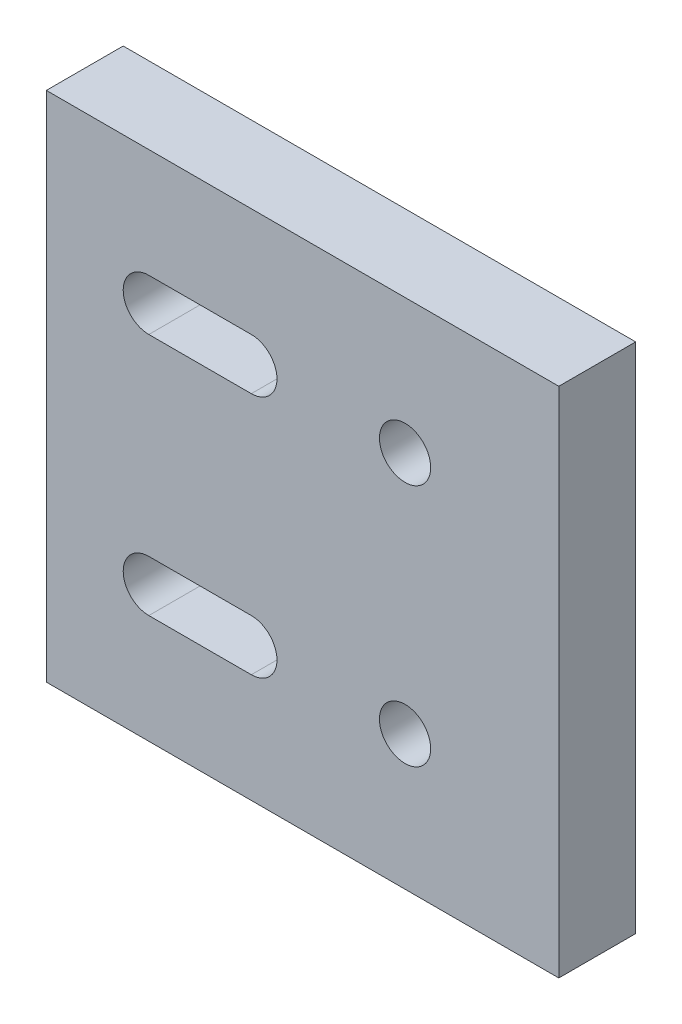
ISO-10303-21;
HEADER;
FILE_DESCRIPTION(('STEP AP214'),'2;1');
FILE_NAME('part.step','',(''),(''),'','','');
FILE_SCHEMA(('AUTOMOTIVE_DESIGN { 1 0 10303 214 1 1 1 1 }'));
ENDSEC;
DATA;
#1=APPLICATION_CONTEXT('core data for automotive mechanical design processes');
#2=APPLICATION_PROTOCOL_DEFINITION('international standard','automotive_design',2000,#1);
#3=PRODUCT_CONTEXT('',#1,'mechanical');
#4=PRODUCT('Part','Part','',(#3));
#5=PRODUCT_RELATED_PRODUCT_CATEGORY('part','',(#4));
#6=PRODUCT_DEFINITION_FORMATION('','',#4);
#7=PRODUCT_DEFINITION_CONTEXT('part definition',#1,'design');
#8=PRODUCT_DEFINITION('design','',#6,#7);
#9=PRODUCT_DEFINITION_SHAPE('','',#8);
#10=(LENGTH_UNIT() NAMED_UNIT(*) SI_UNIT(.MILLI.,.METRE.));
#11=(NAMED_UNIT(*) PLANE_ANGLE_UNIT() SI_UNIT($,.RADIAN.));
#12=(NAMED_UNIT(*) SI_UNIT($,.STERADIAN.) SOLID_ANGLE_UNIT());
#13=UNCERTAINTY_MEASURE_WITH_UNIT(LENGTH_MEASURE(1.E-05),#10,'distance_accuracy_value','');
#14=(GEOMETRIC_REPRESENTATION_CONTEXT(3) GLOBAL_UNCERTAINTY_ASSIGNED_CONTEXT((#13)) GLOBAL_UNIT_ASSIGNED_CONTEXT((#10,
#11,#12)) REPRESENTATION_CONTEXT('',''));
#15=CARTESIAN_POINT('',(0.,0.,0.));
#16=DIRECTION('',(0.,0.,1.));
#17=DIRECTION('',(1.,0.,0.));
#18=AXIS2_PLACEMENT_3D('',#15,#16,#17);
#19=CARTESIAN_POINT('',(0.,0.,3.));
#20=DIRECTION('',(0.,0.,1.));
#21=DIRECTION('',(1.,0.,0.));
#22=AXIS2_PLACEMENT_3D('',#19,#20,#21);
#23=PLANE('',#22);
#24=CARTESIAN_POINT('',(4.,4.75,3.));
#25=DIRECTION('',(0.,0.,1.));
#26=DIRECTION('',(1.,0.,0.));
#27=AXIS2_PLACEMENT_3D('',#24,#25,#26);
#28=CIRCLE('',#27,1.);
#29=CARTESIAN_POINT('',(5.,4.75,3.));
#30=VERTEX_POINT('',#29);
#31=EDGE_CURVE('E212',#30,#30,#28,.T.);
#32=ORIENTED_EDGE('',*,*,#31,.F.);
#33=EDGE_LOOP('',(#32));
#34=FACE_BOUND('',#33,.T.);
#35=DIRECTION('',(0.,-1.,0.));
#36=VECTOR('',#35,1.);
#37=CARTESIAN_POINT('',(-10.,-10.,3.));
#38=LINE('',#37,#36);
#39=CARTESIAN_POINT('',(-10.,10.,3.));
#40=VERTEX_POINT('',#39);
#41=CARTESIAN_POINT('',(-10.,-10.,3.));
#42=VERTEX_POINT('',#41);
#43=EDGE_CURVE('E219',#40,#42,#38,.T.);
#44=ORIENTED_EDGE('',*,*,#43,.T.);
#45=DIRECTION('',(1.,0.,0.));
#46=VECTOR('',#45,1.);
#47=CARTESIAN_POINT('',(10.,-10.,3.));
#48=LINE('',#47,#46);
#49=CARTESIAN_POINT('',(10.,-10.,3.));
#50=VERTEX_POINT('',#49);
#51=EDGE_CURVE('E223',#42,#50,#48,.T.);
#52=ORIENTED_EDGE('',*,*,#51,.T.);
#53=DIRECTION('',(0.,1.,0.));
#54=VECTOR('',#53,1.);
#55=CARTESIAN_POINT('',(10.,-10.,3.));
#56=LINE('',#55,#54);
#57=CARTESIAN_POINT('',(10.,10.,3.));
#58=VERTEX_POINT('',#57);
#59=EDGE_CURVE('E226',#50,#58,#56,.T.);
#60=ORIENTED_EDGE('',*,*,#59,.T.);
#61=DIRECTION('',(-1.,0.,0.));
#62=VECTOR('',#61,1.);
#63=CARTESIAN_POINT('',(10.,10.,3.));
#64=LINE('',#63,#62);
#65=EDGE_CURVE('E229',#58,#40,#64,.T.);
#66=ORIENTED_EDGE('',*,*,#65,.T.);
#67=EDGE_LOOP('',(#44,#52,#60,#66));
#68=FACE_BOUND('',#67,.T.);
#69=CARTESIAN_POINT('',(4.,-4.75,3.));
#70=DIRECTION('',(0.,0.,1.));
#71=DIRECTION('',(1.,0.,0.));
#72=AXIS2_PLACEMENT_3D('',#69,#70,#71);
#73=CIRCLE('',#72,1.);
#74=CARTESIAN_POINT('',(5.00000000000001,-4.75,3.));
#75=VERTEX_POINT('',#74);
#76=EDGE_CURVE('E205',#75,#75,#73,.T.);
#77=ORIENTED_EDGE('',*,*,#76,.F.);
#78=EDGE_LOOP('',(#77));
#79=FACE_BOUND('',#78,.T.);
#80=DIRECTION('',(1.,0.,0.));
#81=VECTOR('',#80,1.);
#82=CARTESIAN_POINT('',(-6.,3.75,3.));
#83=LINE('',#82,#81);
#84=CARTESIAN_POINT('',(-6.,3.75,3.));
#85=VERTEX_POINT('',#84);
#86=CARTESIAN_POINT('',(-2.,3.75,3.));
#87=VERTEX_POINT('',#86);
#88=EDGE_CURVE('E174',#85,#87,#83,.T.);
#89=ORIENTED_EDGE('',*,*,#88,.F.);
#90=CARTESIAN_POINT('',(-6.,4.75,3.));
#91=DIRECTION('',(0.,0.,1.));
#92=DIRECTION('',(1.,0.,0.));
#93=AXIS2_PLACEMENT_3D('',#90,#91,#92);
#94=CIRCLE('',#93,1.);
#95=CARTESIAN_POINT('',(-6.,5.75,3.));
#96=VERTEX_POINT('',#95);
#97=EDGE_CURVE('E172',#96,#85,#94,.T.);
#98=ORIENTED_EDGE('',*,*,#97,.F.);
#99=DIRECTION('',(-1.,0.,0.));
#100=VECTOR('',#99,1.);
#101=CARTESIAN_POINT('',(-6.,5.75,3.));
#102=LINE('',#101,#100);
#103=CARTESIAN_POINT('',(-2.,5.75,3.));
#104=VERTEX_POINT('',#103);
#105=EDGE_CURVE('E181',#104,#96,#102,.T.);
#106=ORIENTED_EDGE('',*,*,#105,.F.);
#107=CARTESIAN_POINT('',(-2.,4.75,3.));
#108=DIRECTION('',(0.,0.,1.));
#109=DIRECTION('',(1.,0.,0.));
#110=AXIS2_PLACEMENT_3D('',#107,#108,#109);
#111=CIRCLE('',#110,1.);
#112=EDGE_CURVE('E178',#87,#104,#111,.T.);
#113=ORIENTED_EDGE('',*,*,#112,.F.);
#114=EDGE_LOOP('',(#89,#98,#106,#113));
#115=FACE_BOUND('',#114,.T.);
#116=DIRECTION('',(1.,0.,0.));
#117=VECTOR('',#116,1.);
#118=CARTESIAN_POINT('',(-6.,-5.75,3.));
#119=LINE('',#118,#117);
#120=CARTESIAN_POINT('',(-6.,-5.75,3.));
#121=VERTEX_POINT('',#120);
#122=CARTESIAN_POINT('',(-2.,-5.75,3.));
#123=VERTEX_POINT('',#122);
#124=EDGE_CURVE('E136',#121,#123,#119,.T.);
#125=ORIENTED_EDGE('',*,*,#124,.F.);
#126=CARTESIAN_POINT('',(-6.,-4.75,3.));
#127=DIRECTION('',(0.,0.,1.));
#128=DIRECTION('',(-1.,0.,0.));
#129=AXIS2_PLACEMENT_3D('',#126,#127,#128);
#130=CIRCLE('',#129,1.);
#131=CARTESIAN_POINT('',(-6.,-3.75,3.));
#132=VERTEX_POINT('',#131);
#133=EDGE_CURVE('E128',#132,#121,#130,.T.);
#134=ORIENTED_EDGE('',*,*,#133,.F.);
#135=DIRECTION('',(-1.,0.,0.));
#136=VECTOR('',#135,1.);
#137=CARTESIAN_POINT('',(-6.,-3.75,3.));
#138=LINE('',#137,#136);
#139=CARTESIAN_POINT('',(-2.,-3.75,3.));
#140=VERTEX_POINT('',#139);
#141=EDGE_CURVE('E155',#140,#132,#138,.T.);
#142=ORIENTED_EDGE('',*,*,#141,.F.);
#143=CARTESIAN_POINT('',(-2.,-4.75,3.));
#144=DIRECTION('',(0.,0.,1.));
#145=DIRECTION('',(-1.,0.,0.));
#146=AXIS2_PLACEMENT_3D('',#143,#144,#145);
#147=CIRCLE('',#146,1.);
#148=EDGE_CURVE('E148',#123,#140,#147,.T.);
#149=ORIENTED_EDGE('',*,*,#148,.F.);
#150=EDGE_LOOP('',(#125,#134,#142,#149));
#151=FACE_BOUND('',#150,.T.);
#152=ADVANCED_FACE('F39',(#34,#68,#79,#115,#151),#23,.T.);
#153=CARTESIAN_POINT('',(0.,0.,0.));
#154=DIRECTION('',(0.,0.,1.));
#155=DIRECTION('',(1.,0.,0.));
#156=AXIS2_PLACEMENT_3D('',#153,#154,#155);
#157=PLANE('',#156);
#158=CARTESIAN_POINT('',(-6.,4.75,0.));
#159=DIRECTION('',(0.,0.,1.));
#160=DIRECTION('',(1.,0.,0.));
#161=AXIS2_PLACEMENT_3D('',#158,#159,#160);
#162=CIRCLE('',#161,1.);
#163=CARTESIAN_POINT('',(-6.,5.75,0.));
#164=VERTEX_POINT('',#163);
#165=CARTESIAN_POINT('',(-6.,3.75,0.));
#166=VERTEX_POINT('',#165);
#167=EDGE_CURVE('E144',#164,#166,#162,.T.);
#168=ORIENTED_EDGE('',*,*,#167,.T.);
#169=DIRECTION('',(1.,0.,0.));
#170=VECTOR('',#169,1.);
#171=CARTESIAN_POINT('',(-6.,3.75,0.));
#172=LINE('',#171,#170);
#173=CARTESIAN_POINT('',(-2.,3.75,0.));
#174=VERTEX_POINT('',#173);
#175=EDGE_CURVE('E187',#166,#174,#172,.T.);
#176=ORIENTED_EDGE('',*,*,#175,.T.);
#177=CARTESIAN_POINT('',(-2.,4.75,0.));
#178=DIRECTION('',(0.,0.,1.));
#179=DIRECTION('',(1.,0.,0.));
#180=AXIS2_PLACEMENT_3D('',#177,#178,#179);
#181=CIRCLE('',#180,1.);
#182=CARTESIAN_POINT('',(-2.,5.75,0.));
#183=VERTEX_POINT('',#182);
#184=EDGE_CURVE('E190',#174,#183,#181,.T.);
#185=ORIENTED_EDGE('',*,*,#184,.T.);
#186=DIRECTION('',(-1.,0.,0.));
#187=VECTOR('',#186,1.);
#188=CARTESIAN_POINT('',(-6.,5.75,0.));
#189=LINE('',#188,#187);
#190=EDGE_CURVE('E175',#183,#164,#189,.T.);
#191=ORIENTED_EDGE('',*,*,#190,.T.);
#192=EDGE_LOOP('',(#168,#176,#185,#191));
#193=FACE_BOUND('',#192,.T.);
#194=DIRECTION('',(0.,-1.,0.));
#195=VECTOR('',#194,1.);
#196=CARTESIAN_POINT('',(-10.,-10.,0.));
#197=LINE('',#196,#195);
#198=CARTESIAN_POINT('',(-10.,10.,0.));
#199=VERTEX_POINT('',#198);
#200=CARTESIAN_POINT('',(-10.,-10.,0.));
#201=VERTEX_POINT('',#200);
#202=EDGE_CURVE('E216',#199,#201,#197,.T.);
#203=ORIENTED_EDGE('',*,*,#202,.F.);
#204=DIRECTION('',(-1.,0.,0.));
#205=VECTOR('',#204,1.);
#206=CARTESIAN_POINT('',(10.,10.,0.));
#207=LINE('',#206,#205);
#208=CARTESIAN_POINT('',(10.,10.,0.));
#209=VERTEX_POINT('',#208);
#210=EDGE_CURVE('E224',#209,#199,#207,.T.);
#211=ORIENTED_EDGE('',*,*,#210,.F.);
#212=DIRECTION('',(0.,1.,0.));
#213=VECTOR('',#212,1.);
#214=CARTESIAN_POINT('',(10.,-10.,0.));
#215=LINE('',#214,#213);
#216=CARTESIAN_POINT('',(10.,-10.,0.));
#217=VERTEX_POINT('',#216);
#218=EDGE_CURVE('E238',#217,#209,#215,.T.);
#219=ORIENTED_EDGE('',*,*,#218,.F.);
#220=DIRECTION('',(1.,0.,0.));
#221=VECTOR('',#220,1.);
#222=CARTESIAN_POINT('',(10.,-10.,0.));
#223=LINE('',#222,#221);
#224=EDGE_CURVE('E235',#201,#217,#223,.T.);
#225=ORIENTED_EDGE('',*,*,#224,.F.);
#226=EDGE_LOOP('',(#203,#211,#219,#225));
#227=FACE_BOUND('',#226,.T.);
#228=CARTESIAN_POINT('',(4.,4.75,0.));
#229=DIRECTION('',(0.,0.,1.));
#230=DIRECTION('',(1.,0.,0.));
#231=AXIS2_PLACEMENT_3D('',#228,#229,#230);
#232=CIRCLE('',#231,1.);
#233=CARTESIAN_POINT('',(5.,4.75,0.));
#234=VERTEX_POINT('',#233);
#235=EDGE_CURVE('E208',#234,#234,#232,.T.);
#236=ORIENTED_EDGE('',*,*,#235,.T.);
#237=EDGE_LOOP('',(#236));
#238=FACE_BOUND('',#237,.T.);
#239=CARTESIAN_POINT('',(4.,-4.75,0.));
#240=DIRECTION('',(0.,0.,1.));
#241=DIRECTION('',(1.,0.,0.));
#242=AXIS2_PLACEMENT_3D('',#239,#240,#241);
#243=CIRCLE('',#242,1.);
#244=CARTESIAN_POINT('',(5.00000000000001,-4.75,0.));
#245=VERTEX_POINT('',#244);
#246=EDGE_CURVE('E204',#245,#245,#243,.T.);
#247=ORIENTED_EDGE('',*,*,#246,.T.);
#248=EDGE_LOOP('',(#247));
#249=FACE_BOUND('',#248,.T.);
#250=CARTESIAN_POINT('',(-6.,-4.75,0.));
#251=DIRECTION('',(0.,0.,1.));
#252=DIRECTION('',(-1.,0.,0.));
#253=AXIS2_PLACEMENT_3D('',#250,#251,#252);
#254=CIRCLE('',#253,1.);
#255=CARTESIAN_POINT('',(-6.,-3.75,0.));
#256=VERTEX_POINT('',#255);
#257=CARTESIAN_POINT('',(-6.,-5.75,0.));
#258=VERTEX_POINT('',#257);
#259=EDGE_CURVE('E62',#256,#258,#254,.T.);
#260=ORIENTED_EDGE('',*,*,#259,.T.);
#261=DIRECTION('',(1.,0.,0.));
#262=VECTOR('',#261,1.);
#263=CARTESIAN_POINT('',(-6.,-5.75,0.));
#264=LINE('',#263,#262);
#265=CARTESIAN_POINT('',(-2.,-5.75,0.));
#266=VERTEX_POINT('',#265);
#267=EDGE_CURVE('E143',#258,#266,#264,.T.);
#268=ORIENTED_EDGE('',*,*,#267,.T.);
#269=CARTESIAN_POINT('',(-2.,-4.75,0.));
#270=DIRECTION('',(0.,0.,1.));
#271=DIRECTION('',(-1.,0.,0.));
#272=AXIS2_PLACEMENT_3D('',#269,#270,#271);
#273=CIRCLE('',#272,1.);
#274=CARTESIAN_POINT('',(-2.,-3.75,0.));
#275=VERTEX_POINT('',#274);
#276=EDGE_CURVE('E162',#266,#275,#273,.T.);
#277=ORIENTED_EDGE('',*,*,#276,.T.);
#278=DIRECTION('',(-1.,0.,0.));
#279=VECTOR('',#278,1.);
#280=CARTESIAN_POINT('',(-6.,-3.75,0.));
#281=LINE('',#280,#279);
#282=EDGE_CURVE('E137',#275,#256,#281,.T.);
#283=ORIENTED_EDGE('',*,*,#282,.T.);
#284=EDGE_LOOP('',(#260,#268,#277,#283));
#285=FACE_BOUND('',#284,.T.);
#286=ADVANCED_FACE('F258',(#193,#227,#238,#249,#285),#157,.F.);
#287=CARTESIAN_POINT('',(-10.,-10.,3.));
#288=DIRECTION('',(1.,0.,0.));
#289=DIRECTION('',(0.,0.,-1.));
#290=AXIS2_PLACEMENT_3D('',#287,#288,#289);
#291=PLANE('',#290);
#292=ORIENTED_EDGE('',*,*,#202,.T.);
#293=DIRECTION('',(0.,0.,-1.));
#294=VECTOR('',#293,1.);
#295=CARTESIAN_POINT('',(-10.,-10.,3.));
#296=LINE('',#295,#294);
#297=EDGE_CURVE('E11',#42,#201,#296,.T.);
#298=ORIENTED_EDGE('',*,*,#297,.F.);
#299=ORIENTED_EDGE('',*,*,#43,.F.);
#300=DIRECTION('',(0.,0.,-1.));
#301=VECTOR('',#300,1.);
#302=CARTESIAN_POINT('',(-10.,10.,3.));
#303=LINE('',#302,#301);
#304=EDGE_CURVE('E231',#40,#199,#303,.T.);
#305=ORIENTED_EDGE('',*,*,#304,.T.);
#306=EDGE_LOOP('',(#292,#298,#299,#305));
#307=FACE_BOUND('',#306,.T.);
#308=ADVANCED_FACE('F41',(#307),#291,.F.);
#309=CARTESIAN_POINT('',(10.,-10.,3.));
#310=DIRECTION('',(0.,1.,0.));
#311=DIRECTION('',(-1.,0.,0.));
#312=AXIS2_PLACEMENT_3D('',#309,#310,#311);
#313=PLANE('',#312);
#314=ORIENTED_EDGE('',*,*,#224,.T.);
#315=DIRECTION('',(0.,0.,-1.));
#316=VECTOR('',#315,1.);
#317=CARTESIAN_POINT('',(10.,-10.,3.));
#318=LINE('',#317,#316);
#319=EDGE_CURVE('E47',#50,#217,#318,.T.);
#320=ORIENTED_EDGE('',*,*,#319,.F.);
#321=ORIENTED_EDGE('',*,*,#51,.F.);
#322=ORIENTED_EDGE('',*,*,#297,.T.);
#323=EDGE_LOOP('',(#314,#320,#321,#322));
#324=FACE_BOUND('',#323,.T.);
#325=ADVANCED_FACE('F269',(#324),#313,.F.);
#326=CARTESIAN_POINT('',(10.,-10.,3.));
#327=DIRECTION('',(-1.,0.,0.));
#328=DIRECTION('',(0.,0.,1.));
#329=AXIS2_PLACEMENT_3D('',#326,#327,#328);
#330=PLANE('',#329);
#331=ORIENTED_EDGE('',*,*,#218,.T.);
#332=DIRECTION('',(0.,0.,-1.));
#333=VECTOR('',#332,1.);
#334=CARTESIAN_POINT('',(10.,10.,3.));
#335=LINE('',#334,#333);
#336=EDGE_CURVE('E245',#58,#209,#335,.T.);
#337=ORIENTED_EDGE('',*,*,#336,.F.);
#338=ORIENTED_EDGE('',*,*,#59,.F.);
#339=ORIENTED_EDGE('',*,*,#319,.T.);
#340=EDGE_LOOP('',(#331,#337,#338,#339));
#341=FACE_BOUND('',#340,.T.);
#342=ADVANCED_FACE('F252',(#341),#330,.F.);
#343=CARTESIAN_POINT('',(10.,10.,3.));
#344=DIRECTION('',(0.,-1.,0.));
#345=DIRECTION('',(1.,0.,0.));
#346=AXIS2_PLACEMENT_3D('',#343,#344,#345);
#347=PLANE('',#346);
#348=ORIENTED_EDGE('',*,*,#210,.T.);
#349=ORIENTED_EDGE('',*,*,#304,.F.);
#350=ORIENTED_EDGE('',*,*,#65,.F.);
#351=ORIENTED_EDGE('',*,*,#336,.T.);
#352=EDGE_LOOP('',(#348,#349,#350,#351));
#353=FACE_BOUND('',#352,.T.);
#354=ADVANCED_FACE('F262',(#353),#347,.F.);
#355=CARTESIAN_POINT('',(4.,4.75,3.));
#356=DIRECTION('',(0.,0.,-1.));
#357=DIRECTION('',(-1.,0.,0.));
#358=AXIS2_PLACEMENT_3D('',#355,#356,#357);
#359=CYLINDRICAL_SURFACE('',#358,1.);
#360=ORIENTED_EDGE('',*,*,#31,.T.);
#361=EDGE_LOOP('',(#360));
#362=FACE_BOUND('',#361,.T.);
#363=ORIENTED_EDGE('',*,*,#235,.F.);
#364=EDGE_LOOP('',(#363));
#365=FACE_BOUND('',#364,.T.);
#366=ADVANCED_FACE('F286',(#362,#365),#359,.F.);
#367=CARTESIAN_POINT('',(4.,-4.75,3.));
#368=DIRECTION('',(0.,0.,-1.));
#369=DIRECTION('',(-1.,0.,0.));
#370=AXIS2_PLACEMENT_3D('',#367,#368,#369);
#371=CYLINDRICAL_SURFACE('',#370,1.);
#372=ORIENTED_EDGE('',*,*,#76,.T.);
#373=EDGE_LOOP('',(#372));
#374=FACE_BOUND('',#373,.T.);
#375=ORIENTED_EDGE('',*,*,#246,.F.);
#376=EDGE_LOOP('',(#375));
#377=FACE_BOUND('',#376,.T.);
#378=ADVANCED_FACE('F292',(#374,#377),#371,.F.);
#379=CARTESIAN_POINT('',(-6.,4.75,3.));
#380=DIRECTION('',(0.,0.,-1.));
#381=DIRECTION('',(-1.,0.,0.));
#382=AXIS2_PLACEMENT_3D('',#379,#380,#381);
#383=CYLINDRICAL_SURFACE('',#382,1.);
#384=ORIENTED_EDGE('',*,*,#167,.F.);
#385=DIRECTION('',(0.,0.,-1.));
#386=VECTOR('',#385,1.);
#387=CARTESIAN_POINT('',(-6.,5.75,3.));
#388=LINE('',#387,#386);
#389=EDGE_CURVE('E184',#96,#164,#388,.T.);
#390=ORIENTED_EDGE('',*,*,#389,.F.);
#391=ORIENTED_EDGE('',*,*,#97,.T.);
#392=DIRECTION('',(0.,0.,-1.));
#393=VECTOR('',#392,1.);
#394=CARTESIAN_POINT('',(-6.,3.75,3.));
#395=LINE('',#394,#393);
#396=EDGE_CURVE('E201',#85,#166,#395,.T.);
#397=ORIENTED_EDGE('',*,*,#396,.T.);
#398=EDGE_LOOP('',(#384,#390,#391,#397));
#399=FACE_BOUND('',#398,.T.);
#400=ADVANCED_FACE('F297',(#399),#383,.F.);
#401=CARTESIAN_POINT('',(-6.,3.75,3.));
#402=DIRECTION('',(0.,1.,0.));
#403=DIRECTION('',(0.,0.,1.));
#404=AXIS2_PLACEMENT_3D('',#401,#402,#403);
#405=PLANE('',#404);
#406=ORIENTED_EDGE('',*,*,#175,.F.);
#407=ORIENTED_EDGE('',*,*,#396,.F.);
#408=ORIENTED_EDGE('',*,*,#88,.T.);
#409=DIRECTION('',(0.,0.,-1.));
#410=VECTOR('',#409,1.);
#411=CARTESIAN_POINT('',(-2.,3.75,3.));
#412=LINE('',#411,#410);
#413=EDGE_CURVE('E199',#87,#174,#412,.T.);
#414=ORIENTED_EDGE('',*,*,#413,.T.);
#415=EDGE_LOOP('',(#406,#407,#408,#414));
#416=FACE_BOUND('',#415,.T.);
#417=ADVANCED_FACE('F326',(#416),#405,.T.);
#418=CARTESIAN_POINT('',(-2.,4.75,3.));
#419=DIRECTION('',(0.,0.,-1.));
#420=DIRECTION('',(-1.,0.,0.));
#421=AXIS2_PLACEMENT_3D('',#418,#419,#420);
#422=CYLINDRICAL_SURFACE('',#421,1.);
#423=ORIENTED_EDGE('',*,*,#184,.F.);
#424=ORIENTED_EDGE('',*,*,#413,.F.);
#425=ORIENTED_EDGE('',*,*,#112,.T.);
#426=DIRECTION('',(0.,0.,-1.));
#427=VECTOR('',#426,1.);
#428=CARTESIAN_POINT('',(-2.,5.75,3.));
#429=LINE('',#428,#427);
#430=EDGE_CURVE('E197',#104,#183,#429,.T.);
#431=ORIENTED_EDGE('',*,*,#430,.T.);
#432=EDGE_LOOP('',(#423,#424,#425,#431));
#433=FACE_BOUND('',#432,.T.);
#434=ADVANCED_FACE('F322',(#433),#422,.F.);
#435=CARTESIAN_POINT('',(-6.,5.75,3.));
#436=DIRECTION('',(0.,-1.,0.));
#437=DIRECTION('',(0.,0.,-1.));
#438=AXIS2_PLACEMENT_3D('',#435,#436,#437);
#439=PLANE('',#438);
#440=ORIENTED_EDGE('',*,*,#190,.F.);
#441=ORIENTED_EDGE('',*,*,#430,.F.);
#442=ORIENTED_EDGE('',*,*,#105,.T.);
#443=ORIENTED_EDGE('',*,*,#389,.T.);
#444=EDGE_LOOP('',(#440,#441,#442,#443));
#445=FACE_BOUND('',#444,.T.);
#446=ADVANCED_FACE('F319',(#445),#439,.T.);
#447=CARTESIAN_POINT('',(-6.,-4.75,3.));
#448=DIRECTION('',(0.,0.,-1.));
#449=DIRECTION('',(-1.,0.,0.));
#450=AXIS2_PLACEMENT_3D('',#447,#448,#449);
#451=CYLINDRICAL_SURFACE('',#450,1.);
#452=ORIENTED_EDGE('',*,*,#259,.F.);
#453=DIRECTION('',(0.,0.,-1.));
#454=VECTOR('',#453,1.);
#455=CARTESIAN_POINT('',(-6.,-3.75,3.));
#456=LINE('',#455,#454);
#457=EDGE_CURVE('E132',#132,#256,#456,.T.);
#458=ORIENTED_EDGE('',*,*,#457,.F.);
#459=ORIENTED_EDGE('',*,*,#133,.T.);
#460=DIRECTION('',(0.,0.,-1.));
#461=VECTOR('',#460,1.);
#462=CARTESIAN_POINT('',(-6.,-5.75,3.));
#463=LINE('',#462,#461);
#464=EDGE_CURVE('E131',#121,#258,#463,.T.);
#465=ORIENTED_EDGE('',*,*,#464,.T.);
#466=EDGE_LOOP('',(#452,#458,#459,#465));
#467=FACE_BOUND('',#466,.T.);
#468=ADVANCED_FACE('F130',(#467),#451,.F.);
#469=CARTESIAN_POINT('',(-6.,-5.75,3.));
#470=DIRECTION('',(0.,1.,0.));
#471=DIRECTION('',(0.,0.,1.));
#472=AXIS2_PLACEMENT_3D('',#469,#470,#471);
#473=PLANE('',#472);
#474=ORIENTED_EDGE('',*,*,#267,.F.);
#475=ORIENTED_EDGE('',*,*,#464,.F.);
#476=ORIENTED_EDGE('',*,*,#124,.T.);
#477=DIRECTION('',(0.,0.,-1.));
#478=VECTOR('',#477,1.);
#479=CARTESIAN_POINT('',(-2.,-5.75,3.));
#480=LINE('',#479,#478);
#481=EDGE_CURVE('E145',#123,#266,#480,.T.);
#482=ORIENTED_EDGE('',*,*,#481,.T.);
#483=EDGE_LOOP('',(#474,#475,#476,#482));
#484=FACE_BOUND('',#483,.T.);
#485=ADVANCED_FACE('F140',(#484),#473,.T.);
#486=CARTESIAN_POINT('',(-2.,-4.75,3.));
#487=DIRECTION('',(0.,0.,-1.));
#488=DIRECTION('',(-1.,0.,0.));
#489=AXIS2_PLACEMENT_3D('',#486,#487,#488);
#490=CYLINDRICAL_SURFACE('',#489,1.);
#491=ORIENTED_EDGE('',*,*,#276,.F.);
#492=ORIENTED_EDGE('',*,*,#481,.F.);
#493=ORIENTED_EDGE('',*,*,#148,.T.);
#494=DIRECTION('',(0.,0.,-1.));
#495=VECTOR('',#494,1.);
#496=CARTESIAN_POINT('',(-2.,-3.75,3.));
#497=LINE('',#496,#495);
#498=EDGE_CURVE('E54',#140,#275,#497,.T.);
#499=ORIENTED_EDGE('',*,*,#498,.T.);
#500=EDGE_LOOP('',(#491,#492,#493,#499));
#501=FACE_BOUND('',#500,.T.);
#502=ADVANCED_FACE('F307',(#501),#490,.F.);
#503=CARTESIAN_POINT('',(-6.,-3.75,3.));
#504=DIRECTION('',(0.,-1.,0.));
#505=DIRECTION('',(0.,0.,-1.));
#506=AXIS2_PLACEMENT_3D('',#503,#504,#505);
#507=PLANE('',#506);
#508=ORIENTED_EDGE('',*,*,#282,.F.);
#509=ORIENTED_EDGE('',*,*,#498,.F.);
#510=ORIENTED_EDGE('',*,*,#141,.T.);
#511=ORIENTED_EDGE('',*,*,#457,.T.);
#512=EDGE_LOOP('',(#508,#509,#510,#511));
#513=FACE_BOUND('',#512,.T.);
#514=ADVANCED_FACE('F305',(#513),#507,.T.);
#515=CLOSED_SHELL('',(#152,#286,#308,#325,#342,#354,#366,#378,#400,#417,#434,#446,#468,#485,
#502,#514));
#516=MANIFOLD_SOLID_BREP('B2',#515);
#517=ADVANCED_BREP_SHAPE_REPRESENTATION('',(#18,#516),#14);
#518=SHAPE_DEFINITION_REPRESENTATION(#9,#517);
ENDSEC;
END-ISO-10303-21;
